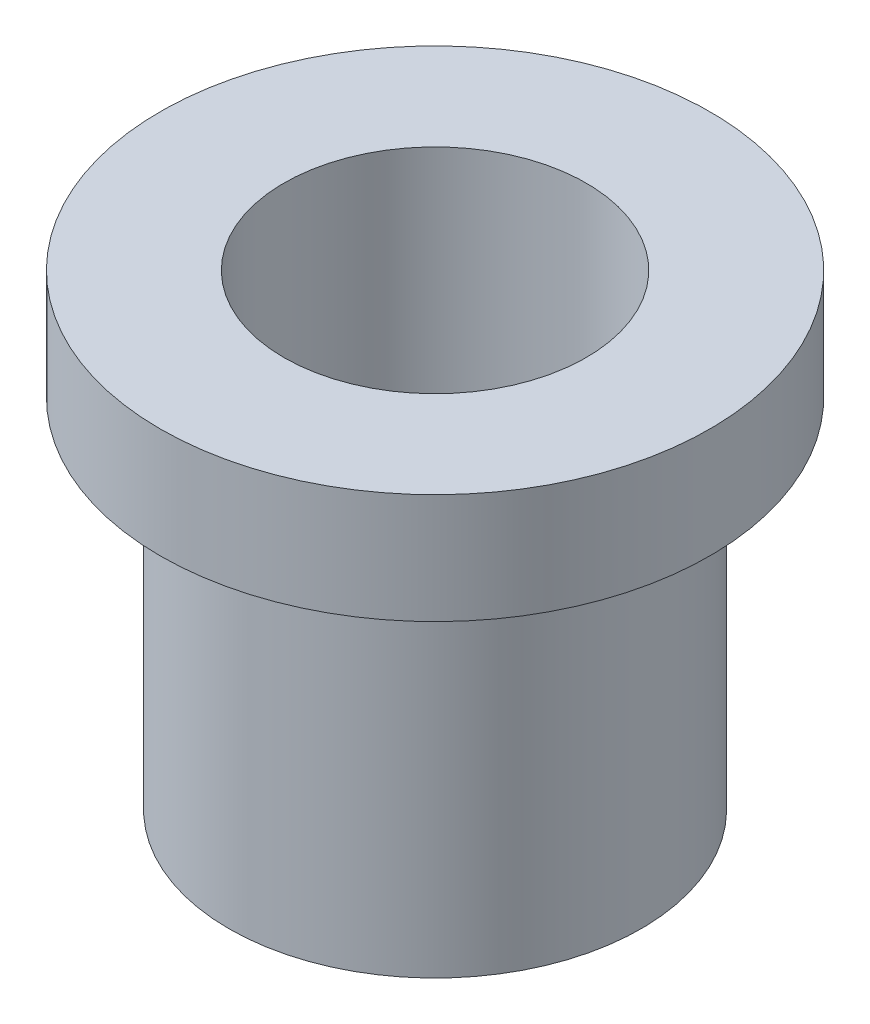
ISO-10303-21;
HEADER;
FILE_DESCRIPTION(('STEP AP214'),'2;1');
FILE_NAME('part.step','',(''),(''),'','','');
FILE_SCHEMA(('AUTOMOTIVE_DESIGN { 1 0 10303 214 1 1 1 1 }'));
ENDSEC;
DATA;
#1=APPLICATION_CONTEXT('core data for automotive mechanical design processes');
#2=APPLICATION_PROTOCOL_DEFINITION('international standard','automotive_design',2000,#1);
#3=PRODUCT_CONTEXT('',#1,'mechanical');
#4=PRODUCT('Part','Part','',(#3));
#5=PRODUCT_RELATED_PRODUCT_CATEGORY('part','',(#4));
#6=PRODUCT_DEFINITION_FORMATION('','',#4);
#7=PRODUCT_DEFINITION_CONTEXT('part definition',#1,'design');
#8=PRODUCT_DEFINITION('design','',#6,#7);
#9=PRODUCT_DEFINITION_SHAPE('','',#8);
#10=(LENGTH_UNIT() NAMED_UNIT(*) SI_UNIT(.MILLI.,.METRE.));
#11=(NAMED_UNIT(*) PLANE_ANGLE_UNIT() SI_UNIT($,.RADIAN.));
#12=(NAMED_UNIT(*) SI_UNIT($,.STERADIAN.) SOLID_ANGLE_UNIT());
#13=UNCERTAINTY_MEASURE_WITH_UNIT(LENGTH_MEASURE(1.E-05),#10,'distance_accuracy_value','');
#14=(GEOMETRIC_REPRESENTATION_CONTEXT(3) GLOBAL_UNCERTAINTY_ASSIGNED_CONTEXT((#13)) GLOBAL_UNIT_ASSIGNED_CONTEXT((#10,
#11,#12)) REPRESENTATION_CONTEXT('',''));
#15=CARTESIAN_POINT('',(0.,0.,0.));
#16=DIRECTION('',(0.,0.,1.));
#17=DIRECTION('',(1.,0.,0.));
#18=AXIS2_PLACEMENT_3D('',#15,#16,#17);
#19=CARTESIAN_POINT('',(0.,12.0355339059327,0.));
#20=DIRECTION('',(0.,-1.,0.));
#21=DIRECTION('',(0.,0.,-1.));
#22=AXIS2_PLACEMENT_3D('',#19,#20,#21);
#23=CYLINDRICAL_SURFACE('',#22,1.25);
#24=CARTESIAN_POINT('',(0.,0.,0.));
#25=DIRECTION('',(0.,-1.,0.));
#26=DIRECTION('',(0.,0.,-1.));
#27=AXIS2_PLACEMENT_3D('',#24,#25,#26);
#28=CIRCLE('',#27,1.25);
#29=CARTESIAN_POINT('',(0.,0.,-1.25));
#30=VERTEX_POINT('',#29);
#31=EDGE_CURVE('E57',#30,#30,#28,.T.);
#32=ORIENTED_EDGE('',*,*,#31,.T.);
#33=EDGE_LOOP('',(#32));
#34=FACE_BOUND('',#33,.T.);
#35=CARTESIAN_POINT('',(0.,3.5,0.));
#36=DIRECTION('',(0.,1.,0.));
#37=DIRECTION('',(0.,0.,1.));
#38=AXIS2_PLACEMENT_3D('',#35,#36,#37);
#39=CIRCLE('',#38,1.25);
#40=CARTESIAN_POINT('',(0.,3.5,1.25));
#41=VERTEX_POINT('',#40);
#42=EDGE_CURVE('E43',#41,#41,#39,.F.);
#43=ORIENTED_EDGE('',*,*,#42,.F.);
#44=EDGE_LOOP('',(#43));
#45=FACE_BOUND('',#44,.T.);
#46=ADVANCED_FACE('F39',(#34,#45),#23,.F.);
#47=CARTESIAN_POINT('',(0.,6.5,0.));
#48=DIRECTION('',(0.,-1.,0.));
#49=DIRECTION('',(0.,0.,-1.));
#50=AXIS2_PLACEMENT_3D('',#47,#48,#49);
#51=CYLINDRICAL_SURFACE('',#50,3.75);
#52=CARTESIAN_POINT('',(0.,6.5,0.));
#53=DIRECTION('',(0.,1.,0.));
#54=DIRECTION('',(0.,0.,1.));
#55=AXIS2_PLACEMENT_3D('',#52,#53,#54);
#56=CIRCLE('',#55,3.75);
#57=CARTESIAN_POINT('',(0.,6.5,3.75));
#58=VERTEX_POINT('',#57);
#59=EDGE_CURVE('E11',#58,#58,#56,.T.);
#60=ORIENTED_EDGE('',*,*,#59,.F.);
#61=EDGE_LOOP('',(#60));
#62=FACE_BOUND('',#61,.T.);
#63=CARTESIAN_POINT('',(0.,0.,0.));
#64=DIRECTION('',(0.,1.,0.));
#65=DIRECTION('',(0.,0.,1.));
#66=AXIS2_PLACEMENT_3D('',#63,#64,#65);
#67=CIRCLE('',#66,3.75);
#68=CARTESIAN_POINT('',(0.,0.,3.75));
#69=VERTEX_POINT('',#68);
#70=EDGE_CURVE('E47',#69,#69,#67,.T.);
#71=ORIENTED_EDGE('',*,*,#70,.T.);
#72=EDGE_LOOP('',(#71));
#73=FACE_BOUND('',#72,.T.);
#74=ADVANCED_FACE('F41',(#62,#73),#51,.T.);
#75=CARTESIAN_POINT('',(0.,0.,0.));
#76=DIRECTION('',(0.,1.,0.));
#77=DIRECTION('',(0.,0.,1.));
#78=AXIS2_PLACEMENT_3D('',#75,#76,#77);
#79=PLANE('',#78);
#80=ORIENTED_EDGE('',*,*,#31,.F.);
#81=EDGE_LOOP('',(#80));
#82=FACE_BOUND('',#81,.T.);
#83=ORIENTED_EDGE('',*,*,#70,.F.);
#84=EDGE_LOOP('',(#83));
#85=FACE_BOUND('',#84,.T.);
#86=ADVANCED_FACE('F82',(#82,#85),#79,.F.);
#87=CARTESIAN_POINT('',(0.,8.5,0.));
#88=DIRECTION('',(0.,-1.,0.));
#89=DIRECTION('',(0.,0.,-1.));
#90=AXIS2_PLACEMENT_3D('',#87,#88,#89);
#91=CYLINDRICAL_SURFACE('',#90,5.);
#92=CARTESIAN_POINT('',(0.,8.5,0.));
#93=DIRECTION('',(0.,1.,0.));
#94=DIRECTION('',(0.,0.,1.));
#95=AXIS2_PLACEMENT_3D('',#92,#93,#94);
#96=CIRCLE('',#95,5.);
#97=CARTESIAN_POINT('',(0.,8.5,5.));
#98=VERTEX_POINT('',#97);
#99=EDGE_CURVE('E52',#98,#98,#96,.T.);
#100=ORIENTED_EDGE('',*,*,#99,.F.);
#101=EDGE_LOOP('',(#100));
#102=FACE_BOUND('',#101,.T.);
#103=CARTESIAN_POINT('',(0.,6.5,0.));
#104=DIRECTION('',(0.,1.,0.));
#105=DIRECTION('',(0.,0.,1.));
#106=AXIS2_PLACEMENT_3D('',#103,#104,#105);
#107=CIRCLE('',#106,5.);
#108=CARTESIAN_POINT('',(0.,6.5,5.));
#109=VERTEX_POINT('',#108);
#110=EDGE_CURVE('E54',#109,#109,#107,.T.);
#111=ORIENTED_EDGE('',*,*,#110,.T.);
#112=EDGE_LOOP('',(#111));
#113=FACE_BOUND('',#112,.T.);
#114=ADVANCED_FACE('F91',(#102,#113),#91,.T.);
#115=CARTESIAN_POINT('',(0.,8.5,0.));
#116=DIRECTION('',(0.,1.,0.));
#117=DIRECTION('',(0.,0.,1.));
#118=AXIS2_PLACEMENT_3D('',#115,#116,#117);
#119=PLANE('',#118);
#120=CARTESIAN_POINT('',(0.,8.5,0.));
#121=DIRECTION('',(0.,1.,0.));
#122=DIRECTION('',(0.,0.,1.));
#123=AXIS2_PLACEMENT_3D('',#120,#121,#122);
#124=CIRCLE('',#123,2.75);
#125=CARTESIAN_POINT('',(0.,8.5,2.75));
#126=VERTEX_POINT('',#125);
#127=EDGE_CURVE('E62',#126,#126,#124,.T.);
#128=ORIENTED_EDGE('',*,*,#127,.F.);
#129=EDGE_LOOP('',(#128));
#130=FACE_BOUND('',#129,.T.);
#131=ORIENTED_EDGE('',*,*,#99,.T.);
#132=EDGE_LOOP('',(#131));
#133=FACE_BOUND('',#132,.T.);
#134=ADVANCED_FACE('F88',(#130,#133),#119,.T.);
#135=CARTESIAN_POINT('',(0.,6.5,0.));
#136=DIRECTION('',(0.,1.,0.));
#137=DIRECTION('',(0.,0.,1.));
#138=AXIS2_PLACEMENT_3D('',#135,#136,#137);
#139=PLANE('',#138);
#140=ORIENTED_EDGE('',*,*,#59,.T.);
#141=EDGE_LOOP('',(#140));
#142=FACE_BOUND('',#141,.T.);
#143=ORIENTED_EDGE('',*,*,#110,.F.);
#144=EDGE_LOOP('',(#143));
#145=FACE_BOUND('',#144,.T.);
#146=ADVANCED_FACE('F90',(#142,#145),#139,.F.);
#147=CARTESIAN_POINT('',(0.,3.5,0.));
#148=DIRECTION('',(0.,1.,0.));
#149=DIRECTION('',(0.,0.,1.));
#150=AXIS2_PLACEMENT_3D('',#147,#148,#149);
#151=PLANE('',#150);
#152=CARTESIAN_POINT('',(0.,3.5,0.));
#153=DIRECTION('',(0.,1.,0.));
#154=DIRECTION('',(0.,0.,1.));
#155=AXIS2_PLACEMENT_3D('',#152,#153,#154);
#156=CIRCLE('',#155,2.75);
#157=CARTESIAN_POINT('',(0.,3.5,2.75));
#158=VERTEX_POINT('',#157);
#159=EDGE_CURVE('E65',#158,#158,#156,.T.);
#160=ORIENTED_EDGE('',*,*,#159,.T.);
#161=EDGE_LOOP('',(#160));
#162=FACE_BOUND('',#161,.T.);
#163=ORIENTED_EDGE('',*,*,#42,.T.);
#164=EDGE_LOOP('',(#163));
#165=FACE_BOUND('',#164,.T.);
#166=ADVANCED_FACE('F72',(#162,#165),#151,.T.);
#167=CARTESIAN_POINT('',(0.,3.5,0.));
#168=DIRECTION('',(0.,1.,0.));
#169=DIRECTION('',(0.,0.,1.));
#170=AXIS2_PLACEMENT_3D('',#167,#168,#169);
#171=CYLINDRICAL_SURFACE('',#170,2.75);
#172=ORIENTED_EDGE('',*,*,#159,.F.);
#173=EDGE_LOOP('',(#172));
#174=FACE_BOUND('',#173,.T.);
#175=ORIENTED_EDGE('',*,*,#127,.T.);
#176=EDGE_LOOP('',(#175));
#177=FACE_BOUND('',#176,.T.);
#178=ADVANCED_FACE('F86',(#174,#177),#171,.F.);
#179=CLOSED_SHELL('',(#46,#74,#86,#114,#134,#146,#166,#178));
#180=MANIFOLD_SOLID_BREP('B2',#179);
#181=ADVANCED_BREP_SHAPE_REPRESENTATION('',(#18,#180),#14);
#182=SHAPE_DEFINITION_REPRESENTATION(#9,#181);
ENDSEC;
END-ISO-10303-21;
